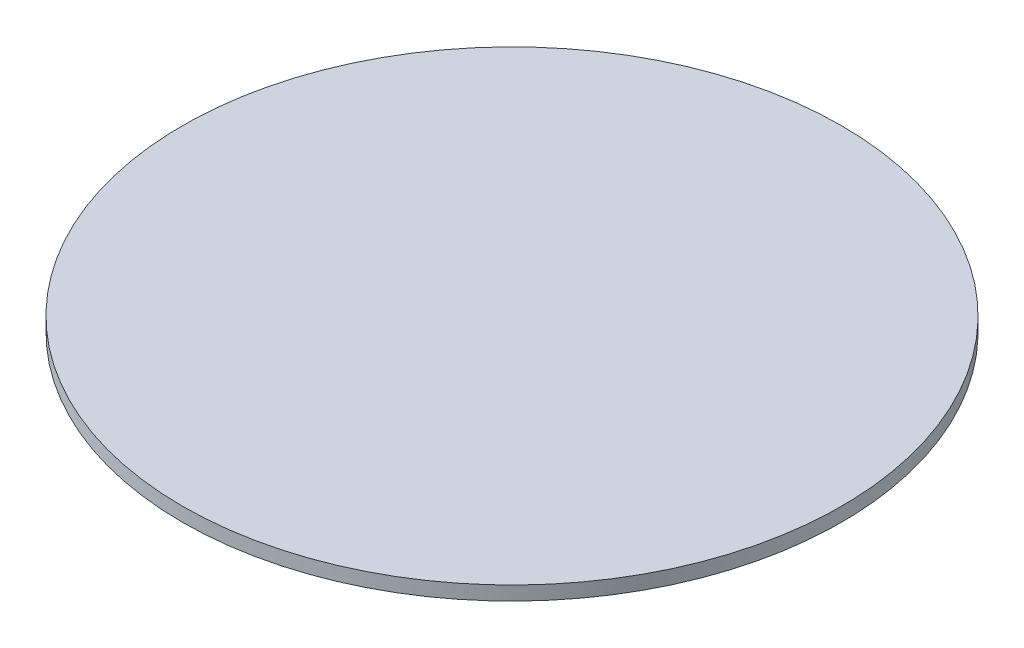
ISO-10303-21;
HEADER;
FILE_DESCRIPTION(('STEP AP214'),'2;1');
FILE_NAME('part.step','',(''),(''),'','','');
FILE_SCHEMA(('AUTOMOTIVE_DESIGN { 1 0 10303 214 1 1 1 1 }'));
ENDSEC;
DATA;
#1=APPLICATION_CONTEXT('core data for automotive mechanical design processes');
#2=APPLICATION_PROTOCOL_DEFINITION('international standard','automotive_design',2000,#1);
#3=PRODUCT_CONTEXT('',#1,'mechanical');
#4=PRODUCT('Part','Part','',(#3));
#5=PRODUCT_RELATED_PRODUCT_CATEGORY('part','',(#4));
#6=PRODUCT_DEFINITION_FORMATION('','',#4);
#7=PRODUCT_DEFINITION_CONTEXT('part definition',#1,'design');
#8=PRODUCT_DEFINITION('design','',#6,#7);
#9=PRODUCT_DEFINITION_SHAPE('','',#8);
#10=(LENGTH_UNIT() NAMED_UNIT(*) SI_UNIT(.MILLI.,.METRE.));
#11=(NAMED_UNIT(*) PLANE_ANGLE_UNIT() SI_UNIT($,.RADIAN.));
#12=(NAMED_UNIT(*) SI_UNIT($,.STERADIAN.) SOLID_ANGLE_UNIT());
#13=UNCERTAINTY_MEASURE_WITH_UNIT(LENGTH_MEASURE(1.E-05),#10,'distance_accuracy_value','');
#14=(GEOMETRIC_REPRESENTATION_CONTEXT(3) GLOBAL_UNCERTAINTY_ASSIGNED_CONTEXT((#13)) GLOBAL_UNIT_ASSIGNED_CONTEXT((#10,
#11,#12)) REPRESENTATION_CONTEXT('',''));
#15=CARTESIAN_POINT('',(0.,0.,0.));
#16=DIRECTION('',(0.,0.,1.));
#17=DIRECTION('',(1.,0.,0.));
#18=AXIS2_PLACEMENT_3D('',#15,#16,#17);
#19=CARTESIAN_POINT('',(0.,6.35,0.));
#20=DIRECTION('',(0.,-1.,0.));
#21=DIRECTION('',(0.,0.,-1.));
#22=AXIS2_PLACEMENT_3D('',#19,#20,#21);
#23=CYLINDRICAL_SURFACE('',#22,150.);
#24=CARTESIAN_POINT('',(0.,6.35,0.));
#25=DIRECTION('',(0.,1.,0.));
#26=DIRECTION('',(0.,0.,1.));
#27=AXIS2_PLACEMENT_3D('',#24,#25,#26);
#28=CIRCLE('',#27,150.);
#29=CARTESIAN_POINT('',(0.,6.35,150.));
#30=VERTEX_POINT('',#29);
#31=EDGE_CURVE('E10',#30,#30,#28,.T.);
#32=ORIENTED_EDGE('',*,*,#31,.F.);
#33=EDGE_LOOP('',(#32));
#34=FACE_BOUND('',#33,.T.);
#35=CARTESIAN_POINT('',(0.,0.,0.));
#36=DIRECTION('',(0.,1.,0.));
#37=DIRECTION('',(0.,0.,1.));
#38=AXIS2_PLACEMENT_3D('',#35,#36,#37);
#39=CIRCLE('',#38,150.);
#40=CARTESIAN_POINT('',(0.,0.,150.));
#41=VERTEX_POINT('',#40);
#42=EDGE_CURVE('E34',#41,#41,#39,.T.);
#43=ORIENTED_EDGE('',*,*,#42,.T.);
#44=EDGE_LOOP('',(#43));
#45=FACE_BOUND('',#44,.T.);
#46=ADVANCED_FACE('F31',(#34,#45),#23,.T.);
#47=CARTESIAN_POINT('',(0.,6.35,0.));
#48=DIRECTION('',(0.,1.,0.));
#49=DIRECTION('',(0.,0.,1.));
#50=AXIS2_PLACEMENT_3D('',#47,#48,#49);
#51=PLANE('',#50);
#52=ORIENTED_EDGE('',*,*,#31,.T.);
#53=EDGE_LOOP('',(#52));
#54=FACE_BOUND('',#53,.T.);
#55=ADVANCED_FACE('F46',(#54),#51,.T.);
#56=CARTESIAN_POINT('',(0.,0.,0.));
#57=DIRECTION('',(0.,1.,0.));
#58=DIRECTION('',(0.,0.,1.));
#59=AXIS2_PLACEMENT_3D('',#56,#57,#58);
#60=PLANE('',#59);
#61=ORIENTED_EDGE('',*,*,#42,.F.);
#62=EDGE_LOOP('',(#61));
#63=FACE_BOUND('',#62,.T.);
#64=ADVANCED_FACE('F44',(#63),#60,.F.);
#65=CLOSED_SHELL('',(#46,#55,#64));
#66=MANIFOLD_SOLID_BREP('B2',#65);
#67=ADVANCED_BREP_SHAPE_REPRESENTATION('',(#18,#66),#14);
#68=SHAPE_DEFINITION_REPRESENTATION(#9,#67);
ENDSEC;
END-ISO-10303-21;
